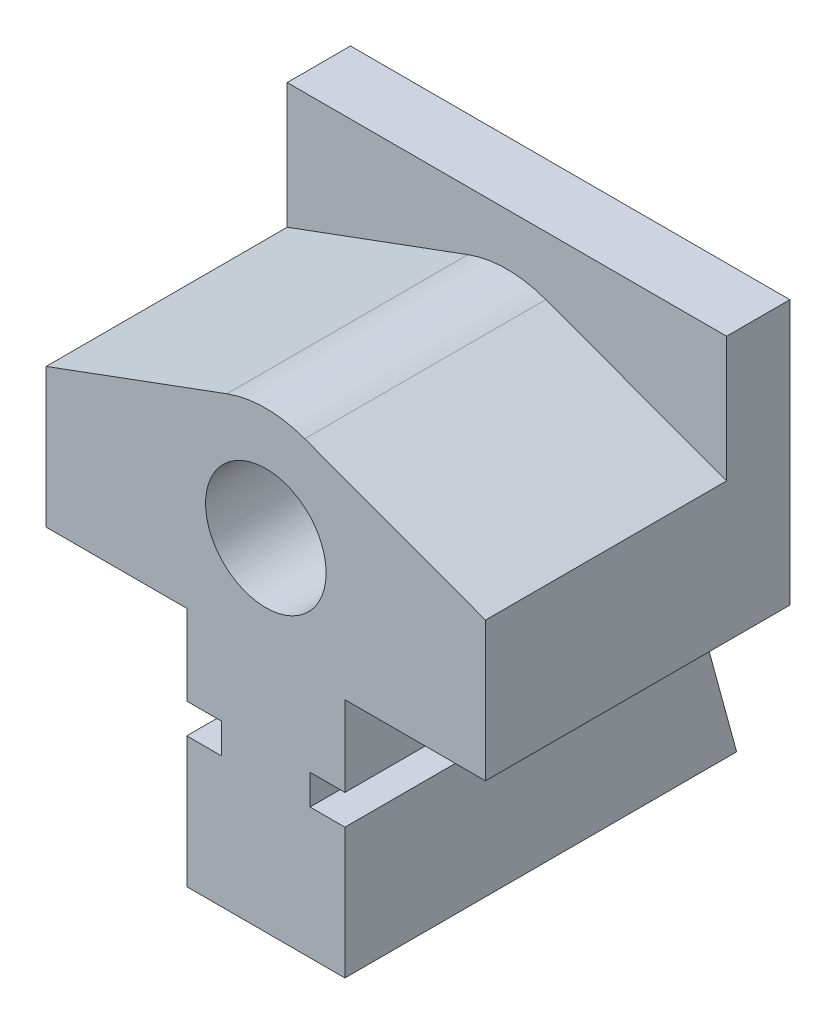
ISO-10303-21;
HEADER;
FILE_DESCRIPTION(('STEP AP214'),'2;1');
FILE_NAME('part.step','',(''),(''),'','','');
FILE_SCHEMA(('AUTOMOTIVE_DESIGN { 1 0 10303 214 1 1 1 1 }'));
ENDSEC;
DATA;
#1=APPLICATION_CONTEXT('core data for automotive mechanical design processes');
#2=APPLICATION_PROTOCOL_DEFINITION('international standard','automotive_design',2000,#1);
#3=PRODUCT_CONTEXT('',#1,'mechanical');
#4=PRODUCT('Part','Part','',(#3));
#5=PRODUCT_RELATED_PRODUCT_CATEGORY('part','',(#4));
#6=PRODUCT_DEFINITION_FORMATION('','',#4);
#7=PRODUCT_DEFINITION_CONTEXT('part definition',#1,'design');
#8=PRODUCT_DEFINITION('design','',#6,#7);
#9=PRODUCT_DEFINITION_SHAPE('','',#8);
#10=(LENGTH_UNIT() NAMED_UNIT(*) SI_UNIT(.MILLI.,.METRE.));
#11=(NAMED_UNIT(*) PLANE_ANGLE_UNIT() SI_UNIT($,.RADIAN.));
#12=(NAMED_UNIT(*) SI_UNIT($,.STERADIAN.) SOLID_ANGLE_UNIT());
#13=UNCERTAINTY_MEASURE_WITH_UNIT(LENGTH_MEASURE(1.E-05),#10,'distance_accuracy_value','');
#14=(GEOMETRIC_REPRESENTATION_CONTEXT(3) GLOBAL_UNCERTAINTY_ASSIGNED_CONTEXT((#13)) GLOBAL_UNIT_ASSIGNED_CONTEXT((#10,
#11,#12)) REPRESENTATION_CONTEXT('',''));
#15=CARTESIAN_POINT('',(0.,0.,0.));
#16=DIRECTION('',(0.,0.,1.));
#17=DIRECTION('',(1.,0.,0.));
#18=AXIS2_PLACEMENT_3D('',#15,#16,#17);
#19=CARTESIAN_POINT('',(-6.9882,20.6502,-38.1));
#20=DIRECTION('',(-1.,0.,0.));
#21=DIRECTION('',(0.,0.,1.));
#22=AXIS2_PLACEMENT_3D('',#19,#20,#21);
#23=PLANE('',#22);
#24=DIRECTION('',(0.,0.964763821237732,0.263117405792109));
#25=VECTOR('',#24,1.);
#26=CARTESIAN_POINT('',(-6.9882,25.2652823076923,-55.0219684615385));
#27=LINE('',#26,#25);
#28=CARTESIAN_POINT('',(-6.9882,20.6502,-56.2806272727273));
#29=VERTEX_POINT('',#28);
#30=CARTESIAN_POINT('',(-6.9882,25.4,-54.9852272727273));
#31=VERTEX_POINT('',#30);
#32=EDGE_CURVE('E470',#29,#31,#27,.T.);
#33=ORIENTED_EDGE('',*,*,#32,.F.);
#34=DIRECTION('',(0.,0.,1.));
#35=VECTOR('',#34,1.);
#36=CARTESIAN_POINT('',(-6.9882,20.6502,-38.1));
#37=LINE('',#36,#35);
#38=CARTESIAN_POINT('',(-6.9882,20.6502,-31.8067935663986));
#39=VERTEX_POINT('',#38);
#40=EDGE_CURVE('E390',#29,#39,#37,.T.);
#41=ORIENTED_EDGE('',*,*,#40,.T.);
#42=DIRECTION('',(0.,-1.,0.));
#43=VECTOR('',#42,1.);
#44=CARTESIAN_POINT('',(-6.9882,0.,-31.8067935663986));
#45=LINE('',#44,#43);
#46=CARTESIAN_POINT('',(-6.9882,25.4,-31.8067935663986));
#47=VERTEX_POINT('',#46);
#48=EDGE_CURVE('E329',#47,#39,#45,.T.);
#49=ORIENTED_EDGE('',*,*,#48,.F.);
#50=DIRECTION('',(0.,0.,1.));
#51=VECTOR('',#50,1.);
#52=CARTESIAN_POINT('',(-6.9882,25.4,-38.1));
#53=LINE('',#52,#51);
#54=EDGE_CURVE('E393',#31,#47,#53,.T.);
#55=ORIENTED_EDGE('',*,*,#54,.F.);
#56=EDGE_LOOP('',(#33,#41,#49,#55));
#57=FACE_BOUND('',#56,.T.);
#58=ADVANCED_FACE('F34',(#57),#23,.T.);
#59=CARTESIAN_POINT('',(6.9882,20.6502,-38.1));
#60=DIRECTION('',(1.,0.,0.));
#61=DIRECTION('',(0.,0.,-1.));
#62=AXIS2_PLACEMENT_3D('',#59,#60,#61);
#63=PLANE('',#62);
#64=DIRECTION('',(0.,-1.,0.));
#65=VECTOR('',#64,1.);
#66=CARTESIAN_POINT('',(6.9882,0.,-28.5182064336013));
#67=LINE('',#66,#65);
#68=CARTESIAN_POINT('',(6.9882,25.4,-28.5182064336013));
#69=VERTEX_POINT('',#68);
#70=CARTESIAN_POINT('',(6.9882,20.6502,-28.5182064336013));
#71=VERTEX_POINT('',#70);
#72=EDGE_CURVE('E348',#69,#71,#67,.T.);
#73=ORIENTED_EDGE('',*,*,#72,.F.);
#74=DIRECTION('',(0.,0.,1.));
#75=VECTOR('',#74,1.);
#76=CARTESIAN_POINT('',(6.9882,25.4,-38.1));
#77=LINE('',#76,#75);
#78=CARTESIAN_POINT('',(6.9882,25.4,0.));
#79=VERTEX_POINT('',#78);
#80=EDGE_CURVE('E378',#69,#79,#77,.T.);
#81=ORIENTED_EDGE('',*,*,#80,.T.);
#82=DIRECTION('',(0.,1.,0.));
#83=VECTOR('',#82,1.);
#84=CARTESIAN_POINT('',(6.9882,20.6502,0.));
#85=LINE('',#84,#83);
#86=CARTESIAN_POINT('',(6.9882,20.6502,0.));
#87=VERTEX_POINT('',#86);
#88=EDGE_CURVE('E447',#87,#79,#85,.T.);
#89=ORIENTED_EDGE('',*,*,#88,.F.);
#90=DIRECTION('',(0.,0.,1.));
#91=VECTOR('',#90,1.);
#92=CARTESIAN_POINT('',(6.9882,20.6502,-38.1));
#93=LINE('',#92,#91);
#94=EDGE_CURVE('E381',#71,#87,#93,.T.);
#95=ORIENTED_EDGE('',*,*,#94,.F.);
#96=EDGE_LOOP('',(#73,#81,#89,#95));
#97=FACE_BOUND('',#96,.T.);
#98=ADVANCED_FACE('F518',(#97),#63,.T.);
#99=CARTESIAN_POINT('',(12.5,38.1,-38.1));
#100=DIRECTION('',(0.,-1.,0.));
#101=DIRECTION('',(0.,0.,-1.));
#102=AXIS2_PLACEMENT_3D('',#99,#100,#101);
#103=PLANE('',#102);
#104=DIRECTION('',(0.,0.,1.));
#105=VECTOR('',#104,1.);
#106=CARTESIAN_POINT('',(12.5,38.1,-38.1));
#107=LINE('',#106,#105);
#108=CARTESIAN_POINT('',(12.5,38.1,-43.1));
#109=VERTEX_POINT('',#108);
#110=CARTESIAN_POINT('',(12.5,38.1,0.));
#111=VERTEX_POINT('',#110);
#112=EDGE_CURVE('E304',#109,#111,#107,.T.);
#113=ORIENTED_EDGE('',*,*,#112,.F.);
#114=DIRECTION('',(1.,0.,0.));
#115=VECTOR('',#114,1.);
#116=CARTESIAN_POINT('',(-34.72505,38.1,-43.1));
#117=LINE('',#116,#115);
#118=CARTESIAN_POINT('',(-12.5,38.1,-43.1));
#119=VERTEX_POINT('',#118);
#120=EDGE_CURVE('E350',#119,#109,#117,.T.);
#121=ORIENTED_EDGE('',*,*,#120,.F.);
#122=DIRECTION('',(0.,0.,1.));
#123=VECTOR('',#122,1.);
#124=CARTESIAN_POINT('',(-12.5,38.1,-38.1));
#125=LINE('',#124,#123);
#126=CARTESIAN_POINT('',(-12.5,38.1,0.));
#127=VERTEX_POINT('',#126);
#128=EDGE_CURVE('E301',#119,#127,#125,.T.);
#129=ORIENTED_EDGE('',*,*,#128,.T.);
#130=DIRECTION('',(1.,0.,0.));
#131=VECTOR('',#130,1.);
#132=CARTESIAN_POINT('',(-12.5,38.1,0.));
#133=LINE('',#132,#131);
#134=CARTESIAN_POINT('',(-34.725,38.1,0.));
#135=VERTEX_POINT('',#134);
#136=EDGE_CURVE('E421',#135,#127,#133,.T.);
#137=ORIENTED_EDGE('',*,*,#136,.F.);
#138=DIRECTION('',(0.,0.,1.));
#139=VECTOR('',#138,1.);
#140=CARTESIAN_POINT('',(-34.725,38.1,-38.1));
#141=LINE('',#140,#139);
#142=CARTESIAN_POINT('',(-34.725,38.1,-48.1));
#143=VERTEX_POINT('',#142);
#144=EDGE_CURVE('E366',#143,#135,#141,.T.);
#145=ORIENTED_EDGE('',*,*,#144,.F.);
#146=DIRECTION('',(-1.,0.,0.));
#147=VECTOR('',#146,1.);
#148=CARTESIAN_POINT('',(34.725,38.1,-48.1));
#149=LINE('',#148,#147);
#150=CARTESIAN_POINT('',(34.725,38.1,-48.1));
#151=VERTEX_POINT('',#150);
#152=EDGE_CURVE('E247',#151,#143,#149,.T.);
#153=ORIENTED_EDGE('',*,*,#152,.F.);
#154=DIRECTION('',(0.,0.,1.));
#155=VECTOR('',#154,1.);
#156=CARTESIAN_POINT('',(34.725,38.1,-38.1));
#157=LINE('',#156,#155);
#158=CARTESIAN_POINT('',(34.725,38.1,0.));
#159=VERTEX_POINT('',#158);
#160=EDGE_CURVE('E306',#151,#159,#157,.T.);
#161=ORIENTED_EDGE('',*,*,#160,.T.);
#162=DIRECTION('',(1.,0.,0.));
#163=VECTOR('',#162,1.);
#164=CARTESIAN_POINT('',(12.5,38.1,0.));
#165=LINE('',#164,#163);
#166=EDGE_CURVE('E362',#111,#159,#165,.T.);
#167=ORIENTED_EDGE('',*,*,#166,.F.);
#168=EDGE_LOOP('',(#113,#121,#129,#137,#145,#153,#161,#167));
#169=FACE_BOUND('',#168,.T.);
#170=ADVANCED_FACE('F360',(#169),#103,.T.);
#171=CARTESIAN_POINT('',(34.725,38.1,-38.1));
#172=DIRECTION('',(1.,0.,0.));
#173=DIRECTION('',(0.,0.,-1.));
#174=AXIS2_PLACEMENT_3D('',#171,#172,#173);
#175=PLANE('',#174);
#176=DIRECTION('',(0.,1.,0.));
#177=VECTOR('',#176,1.);
#178=CARTESIAN_POINT('',(34.725,38.1,0.));
#179=LINE('',#178,#177);
#180=CARTESIAN_POINT('',(34.725,60.1070633418544,0.));
#181=VERTEX_POINT('',#180);
#182=EDGE_CURVE('E416',#159,#181,#179,.T.);
#183=ORIENTED_EDGE('',*,*,#182,.F.);
#184=ORIENTED_EDGE('',*,*,#160,.F.);
#185=DIRECTION('',(0.,-1.,0.));
#186=VECTOR('',#185,1.);
#187=CARTESIAN_POINT('',(34.725,38.1,-48.1));
#188=LINE('',#187,#186);
#189=CARTESIAN_POINT('',(34.725,79.9140129649345,-48.1));
#190=VERTEX_POINT('',#189);
#191=EDGE_CURVE('E244',#190,#151,#188,.T.);
#192=ORIENTED_EDGE('',*,*,#191,.F.);
#193=DIRECTION('',(0.,0.,1.));
#194=VECTOR('',#193,1.);
#195=CARTESIAN_POINT('',(34.725,79.9140129649345,-48.1));
#196=LINE('',#195,#194);
#197=CARTESIAN_POINT('',(34.725,79.9140129649345,-38.1));
#198=VERTEX_POINT('',#197);
#199=EDGE_CURVE('E254',#190,#198,#196,.T.);
#200=ORIENTED_EDGE('',*,*,#199,.T.);
#201=DIRECTION('',(0.,-1.,0.));
#202=VECTOR('',#201,1.);
#203=CARTESIAN_POINT('',(34.725,38.1,-38.1));
#204=LINE('',#203,#202);
#205=CARTESIAN_POINT('',(34.725,60.1070633418544,-38.1));
#206=VERTEX_POINT('',#205);
#207=EDGE_CURVE('E243',#198,#206,#204,.T.);
#208=ORIENTED_EDGE('',*,*,#207,.T.);
#209=DIRECTION('',(0.,0.,1.));
#210=VECTOR('',#209,1.);
#211=CARTESIAN_POINT('',(34.725,60.1070633418544,-111.022498577848));
#212=LINE('',#211,#210);
#213=EDGE_CURVE('E292',#206,#181,#212,.T.);
#214=ORIENTED_EDGE('',*,*,#213,.T.);
#215=EDGE_LOOP('',(#183,#184,#192,#200,#208,#214));
#216=FACE_BOUND('',#215,.T.);
#217=ADVANCED_FACE('F36',(#216),#175,.T.);
#218=CARTESIAN_POINT('',(12.5,25.4,-38.1));
#219=DIRECTION('',(1.,0.,0.));
#220=DIRECTION('',(0.,0.,-1.));
#221=AXIS2_PLACEMENT_3D('',#218,#219,#220);
#222=PLANE('',#221);
#223=DIRECTION('',(0.,-0.964763821237732,-0.263117405792109));
#224=VECTOR('',#223,1.);
#225=CARTESIAN_POINT('',(12.5,29.68625,-53.81625));
#226=LINE('',#225,#224);
#227=CARTESIAN_POINT('',(12.5,34.925,-52.3875));
#228=VERTEX_POINT('',#227);
#229=CARTESIAN_POINT('',(12.5,25.4,-54.9852272727273));
#230=VERTEX_POINT('',#229);
#231=EDGE_CURVE('E212',#228,#230,#226,.T.);
#232=ORIENTED_EDGE('',*,*,#231,.F.);
#233=DIRECTION('',(0.,0.,-1.));
#234=VECTOR('',#233,1.);
#235=CARTESIAN_POINT('',(12.5,34.925,-38.1));
#236=LINE('',#235,#234);
#237=CARTESIAN_POINT('',(12.5,34.925,-46.275));
#238=VERTEX_POINT('',#237);
#239=EDGE_CURVE('E222',#238,#228,#236,.T.);
#240=ORIENTED_EDGE('',*,*,#239,.F.);
#241=CARTESIAN_POINT('',(12.5,38.1,-46.275));
#242=DIRECTION('',(1.,0.,0.));
#243=DIRECTION('',(0.,0.,-1.));
#244=AXIS2_PLACEMENT_3D('',#241,#242,#243);
#245=CIRCLE('',#244,3.17499999999999);
#246=EDGE_CURVE('E235',#109,#238,#245,.T.);
#247=ORIENTED_EDGE('',*,*,#246,.F.);
#248=ORIENTED_EDGE('',*,*,#112,.T.);
#249=DIRECTION('',(0.,1.,0.));
#250=VECTOR('',#249,1.);
#251=CARTESIAN_POINT('',(12.5,25.4,0.));
#252=LINE('',#251,#250);
#253=CARTESIAN_POINT('',(12.5,25.4,0.));
#254=VERTEX_POINT('',#253);
#255=EDGE_CURVE('E367',#254,#111,#252,.T.);
#256=ORIENTED_EDGE('',*,*,#255,.F.);
#257=DIRECTION('',(0.,0.,1.));
#258=VECTOR('',#257,1.);
#259=CARTESIAN_POINT('',(12.5,25.4,-38.1));
#260=LINE('',#259,#258);
#261=EDGE_CURVE('E224',#230,#254,#260,.T.);
#262=ORIENTED_EDGE('',*,*,#261,.F.);
#263=EDGE_LOOP('',(#232,#240,#247,#248,#256,#262));
#264=FACE_BOUND('',#263,.T.);
#265=ADVANCED_FACE('F220',(#264),#222,.T.);
#266=CARTESIAN_POINT('',(6.9882,25.4,-38.1));
#267=DIRECTION('',(0.,-1.,0.));
#268=DIRECTION('',(0.,0.,-1.));
#269=AXIS2_PLACEMENT_3D('',#266,#267,#268);
#270=PLANE('',#269);
#271=DIRECTION('',(-1.,0.,0.));
#272=VECTOR('',#271,1.);
#273=CARTESIAN_POINT('',(6.9882,25.4,-54.9852272727273));
#274=LINE('',#273,#272);
#275=CARTESIAN_POINT('',(6.9882,25.4,-54.9852272727273));
#276=VERTEX_POINT('',#275);
#277=EDGE_CURVE('E226',#230,#276,#274,.T.);
#278=ORIENTED_EDGE('',*,*,#277,.F.);
#279=ORIENTED_EDGE('',*,*,#261,.T.);
#280=DIRECTION('',(1.,0.,0.));
#281=VECTOR('',#280,1.);
#282=CARTESIAN_POINT('',(6.9882,25.4,0.));
#283=LINE('',#282,#281);
#284=EDGE_CURVE('E370',#79,#254,#283,.T.);
#285=ORIENTED_EDGE('',*,*,#284,.F.);
#286=ORIENTED_EDGE('',*,*,#80,.F.);
#287=CARTESIAN_POINT('',(7.9375,25.4,-30.1625));
#288=DIRECTION('',(0.,-1.,0.));
#289=DIRECTION('',(0.,0.,-1.));
#290=AXIS2_PLACEMENT_3D('',#287,#288,#289);
#291=CIRCLE('',#290,1.89865);
#292=CARTESIAN_POINT('',(6.9882,25.4,-31.8067935663986));
#293=VERTEX_POINT('',#292);
#294=EDGE_CURVE('E346',#293,#69,#291,.T.);
#295=ORIENTED_EDGE('',*,*,#294,.F.);
#296=EDGE_CURVE('E376',#276,#293,#77,.T.);
#297=ORIENTED_EDGE('',*,*,#296,.F.);
#298=EDGE_LOOP('',(#278,#279,#285,#286,#295,#297));
#299=FACE_BOUND('',#298,.T.);
#300=ADVANCED_FACE('F454',(#299),#270,.T.);
#301=DIRECTION('',(0.,-0.964763821237732,-0.263117405792109));
#302=VECTOR('',#301,1.);
#303=CARTESIAN_POINT('',(6.9882,25.2652823076923,-55.0219684615385));
#304=LINE('',#303,#302);
#305=CARTESIAN_POINT('',(6.9882,20.6502,-56.2806272727273));
#306=VERTEX_POINT('',#305);
#307=EDGE_CURVE('E458',#276,#306,#304,.T.);
#308=ORIENTED_EDGE('',*,*,#307,.F.);
#309=ORIENTED_EDGE('',*,*,#296,.T.);
#310=DIRECTION('',(0.,-1.,0.));
#311=VECTOR('',#310,1.);
#312=CARTESIAN_POINT('',(6.9882,0.,-31.8067935663986));
#313=LINE('',#312,#311);
#314=CARTESIAN_POINT('',(6.9882,20.6502,-31.8067935663986));
#315=VERTEX_POINT('',#314);
#316=EDGE_CURVE('E343',#315,#293,#313,.F.);
#317=ORIENTED_EDGE('',*,*,#316,.F.);
#318=EDGE_CURVE('E379',#306,#315,#93,.T.);
#319=ORIENTED_EDGE('',*,*,#318,.F.);
#320=EDGE_LOOP('',(#308,#309,#317,#319));
#321=FACE_BOUND('',#320,.T.);
#322=ADVANCED_FACE('F527',(#321),#63,.T.);
#323=CARTESIAN_POINT('',(12.5,20.6502,-38.1));
#324=DIRECTION('',(0.,1.,0.));
#325=DIRECTION('',(0.,0.,1.));
#326=AXIS2_PLACEMENT_3D('',#323,#324,#325);
#327=PLANE('',#326);
#328=DIRECTION('',(1.,0.,0.));
#329=VECTOR('',#328,1.);
#330=CARTESIAN_POINT('',(12.5,20.6502,-56.2806272727273));
#331=LINE('',#330,#329);
#332=CARTESIAN_POINT('',(12.5,20.6502,-56.2806272727273));
#333=VERTEX_POINT('',#332);
#334=EDGE_CURVE('E460',#306,#333,#331,.T.);
#335=ORIENTED_EDGE('',*,*,#334,.F.);
#336=ORIENTED_EDGE('',*,*,#318,.T.);
#337=CARTESIAN_POINT('',(7.9375,20.6502,-30.1625));
#338=DIRECTION('',(0.,1.,0.));
#339=DIRECTION('',(0.,0.,1.));
#340=AXIS2_PLACEMENT_3D('',#337,#338,#339);
#341=CIRCLE('',#340,1.89865);
#342=EDGE_CURVE('E340',#71,#315,#341,.T.);
#343=ORIENTED_EDGE('',*,*,#342,.F.);
#344=ORIENTED_EDGE('',*,*,#94,.T.);
#345=DIRECTION('',(-1.,0.,0.));
#346=VECTOR('',#345,1.);
#347=CARTESIAN_POINT('',(12.5,20.6502,0.));
#348=LINE('',#347,#346);
#349=CARTESIAN_POINT('',(12.5,20.6502,0.));
#350=VERTEX_POINT('',#349);
#351=EDGE_CURVE('E444',#350,#87,#348,.T.);
#352=ORIENTED_EDGE('',*,*,#351,.F.);
#353=DIRECTION('',(0.,0.,1.));
#354=VECTOR('',#353,1.);
#355=CARTESIAN_POINT('',(12.5,20.6502,-38.1));
#356=LINE('',#355,#354);
#357=EDGE_CURVE('E382',#333,#350,#356,.T.);
#358=ORIENTED_EDGE('',*,*,#357,.F.);
#359=EDGE_LOOP('',(#335,#336,#343,#344,#352,#358));
#360=FACE_BOUND('',#359,.T.);
#361=ADVANCED_FACE('F562',(#360),#327,.T.);
#362=CARTESIAN_POINT('',(12.5,0.,-38.1));
#363=DIRECTION('',(1.,0.,0.));
#364=DIRECTION('',(0.,0.,-1.));
#365=AXIS2_PLACEMENT_3D('',#362,#363,#364);
#366=PLANE('',#365);
#367=DIRECTION('',(0.,-0.964763821237732,-0.263117405792109));
#368=VECTOR('',#367,1.);
#369=CARTESIAN_POINT('',(12.5,6.04471153846153,-60.2639423076923));
#370=LINE('',#369,#368);
#371=CARTESIAN_POINT('',(12.5,0.,-61.9125));
#372=VERTEX_POINT('',#371);
#373=EDGE_CURVE('E464',#333,#372,#370,.T.);
#374=ORIENTED_EDGE('',*,*,#373,.F.);
#375=ORIENTED_EDGE('',*,*,#357,.T.);
#376=DIRECTION('',(0.,1.,0.));
#377=VECTOR('',#376,1.);
#378=CARTESIAN_POINT('',(12.5,0.,0.));
#379=LINE('',#378,#377);
#380=CARTESIAN_POINT('',(12.5,0.,0.));
#381=VERTEX_POINT('',#380);
#382=EDGE_CURVE('E441',#381,#350,#379,.T.);
#383=ORIENTED_EDGE('',*,*,#382,.F.);
#384=DIRECTION('',(0.,0.,1.));
#385=VECTOR('',#384,1.);
#386=CARTESIAN_POINT('',(12.5,0.,-38.1));
#387=LINE('',#386,#385);
#388=EDGE_CURVE('E384',#372,#381,#387,.T.);
#389=ORIENTED_EDGE('',*,*,#388,.F.);
#390=EDGE_LOOP('',(#374,#375,#383,#389));
#391=FACE_BOUND('',#390,.T.);
#392=ADVANCED_FACE('F557',(#391),#366,.T.);
#393=CARTESIAN_POINT('',(12.5,0.,-38.1));
#394=DIRECTION('',(0.,-1.,0.));
#395=DIRECTION('',(0.,0.,-1.));
#396=AXIS2_PLACEMENT_3D('',#393,#394,#395);
#397=PLANE('',#396);
#398=CARTESIAN_POINT('',(-7.9375,0.,-30.1625));
#399=DIRECTION('',(0.,-1.,0.));
#400=DIRECTION('',(0.,0.,-1.));
#401=AXIS2_PLACEMENT_3D('',#398,#399,#400);
#402=CIRCLE('',#401,1.89865);
#403=CARTESIAN_POINT('',(-7.9375,0.,-32.06115));
#404=VERTEX_POINT('',#403);
#405=EDGE_CURVE('E325',#404,#404,#402,.T.);
#406=ORIENTED_EDGE('',*,*,#405,.F.);
#407=EDGE_LOOP('',(#406));
#408=FACE_BOUND('',#407,.T.);
#409=CARTESIAN_POINT('',(7.9375,0.,-30.1625));
#410=DIRECTION('',(0.,-1.,0.));
#411=DIRECTION('',(0.,0.,-1.));
#412=AXIS2_PLACEMENT_3D('',#409,#410,#411);
#413=CIRCLE('',#412,1.89865);
#414=CARTESIAN_POINT('',(7.9375,0.,-32.06115));
#415=VERTEX_POINT('',#414);
#416=EDGE_CURVE('E337',#415,#415,#413,.T.);
#417=ORIENTED_EDGE('',*,*,#416,.F.);
#418=EDGE_LOOP('',(#417));
#419=FACE_BOUND('',#418,.T.);
#420=DIRECTION('',(1.,0.,0.));
#421=VECTOR('',#420,1.);
#422=CARTESIAN_POINT('',(12.5,0.,0.));
#423=LINE('',#422,#421);
#424=CARTESIAN_POINT('',(-12.5,0.,0.));
#425=VERTEX_POINT('',#424);
#426=EDGE_CURVE('E438',#425,#381,#423,.T.);
#427=ORIENTED_EDGE('',*,*,#426,.F.);
#428=DIRECTION('',(0.,0.,1.));
#429=VECTOR('',#428,1.);
#430=CARTESIAN_POINT('',(-12.5,0.,-38.1));
#431=LINE('',#430,#429);
#432=CARTESIAN_POINT('',(-12.5,0.,-61.9125));
#433=VERTEX_POINT('',#432);
#434=EDGE_CURVE('E386',#433,#425,#431,.T.);
#435=ORIENTED_EDGE('',*,*,#434,.F.);
#436=DIRECTION('',(-1.,0.,0.));
#437=VECTOR('',#436,1.);
#438=CARTESIAN_POINT('',(12.5,0.,-61.9125));
#439=LINE('',#438,#437);
#440=EDGE_CURVE('E241',#372,#433,#439,.T.);
#441=ORIENTED_EDGE('',*,*,#440,.F.);
#442=ORIENTED_EDGE('',*,*,#388,.T.);
#443=EDGE_LOOP('',(#427,#435,#441,#442));
#444=FACE_BOUND('',#443,.T.);
#445=ADVANCED_FACE('F552',(#408,#419,#444),#397,.T.);
#446=CARTESIAN_POINT('',(-12.5,0.,-38.1));
#447=DIRECTION('',(-1.,0.,0.));
#448=DIRECTION('',(0.,0.,1.));
#449=AXIS2_PLACEMENT_3D('',#446,#447,#448);
#450=PLANE('',#449);
#451=DIRECTION('',(0.,0.964763821237732,0.263117405792109));
#452=VECTOR('',#451,1.);
#453=CARTESIAN_POINT('',(-12.5,6.04471153846153,-60.2639423076923));
#454=LINE('',#453,#452);
#455=CARTESIAN_POINT('',(-12.5,20.6502,-56.2806272727273));
#456=VERTEX_POINT('',#455);
#457=EDGE_CURVE('E466',#433,#456,#454,.T.);
#458=ORIENTED_EDGE('',*,*,#457,.F.);
#459=ORIENTED_EDGE('',*,*,#434,.T.);
#460=DIRECTION('',(0.,-1.,0.));
#461=VECTOR('',#460,1.);
#462=CARTESIAN_POINT('',(-12.5,0.,0.));
#463=LINE('',#462,#461);
#464=CARTESIAN_POINT('',(-12.5,20.6502,0.));
#465=VERTEX_POINT('',#464);
#466=EDGE_CURVE('E435',#465,#425,#463,.T.);
#467=ORIENTED_EDGE('',*,*,#466,.F.);
#468=DIRECTION('',(0.,0.,1.));
#469=VECTOR('',#468,1.);
#470=CARTESIAN_POINT('',(-12.5,20.6502,-38.1));
#471=LINE('',#470,#469);
#472=EDGE_CURVE('E388',#456,#465,#471,.T.);
#473=ORIENTED_EDGE('',*,*,#472,.F.);
#474=EDGE_LOOP('',(#458,#459,#467,#473));
#475=FACE_BOUND('',#474,.T.);
#476=ADVANCED_FACE('F537',(#475),#450,.T.);
#477=CARTESIAN_POINT('',(-12.5,20.6502,-38.1));
#478=DIRECTION('',(0.,1.,0.));
#479=DIRECTION('',(0.,0.,1.));
#480=AXIS2_PLACEMENT_3D('',#477,#478,#479);
#481=PLANE('',#480);
#482=DIRECTION('',(1.,0.,0.));
#483=VECTOR('',#482,1.);
#484=CARTESIAN_POINT('',(-12.5,20.6502,-56.2806272727273));
#485=LINE('',#484,#483);
#486=EDGE_CURVE('E468',#456,#29,#485,.T.);
#487=ORIENTED_EDGE('',*,*,#486,.F.);
#488=ORIENTED_EDGE('',*,*,#472,.T.);
#489=DIRECTION('',(-1.,0.,0.));
#490=VECTOR('',#489,1.);
#491=CARTESIAN_POINT('',(-12.5,20.6502,0.));
#492=LINE('',#491,#490);
#493=CARTESIAN_POINT('',(-6.9882,20.6502,0.));
#494=VERTEX_POINT('',#493);
#495=EDGE_CURVE('E432',#494,#465,#492,.T.);
#496=ORIENTED_EDGE('',*,*,#495,.F.);
#497=CARTESIAN_POINT('',(-6.9882,20.6502,-28.5182064336013));
#498=VERTEX_POINT('',#497);
#499=EDGE_CURVE('E392',#498,#494,#37,.T.);
#500=ORIENTED_EDGE('',*,*,#499,.F.);
#501=CARTESIAN_POINT('',(-7.9375,20.6502,-30.1625));
#502=DIRECTION('',(0.,1.,0.));
#503=DIRECTION('',(0.,0.,1.));
#504=AXIS2_PLACEMENT_3D('',#501,#502,#503);
#505=CIRCLE('',#504,1.89865);
#506=EDGE_CURVE('E332',#39,#498,#505,.T.);
#507=ORIENTED_EDGE('',*,*,#506,.F.);
#508=ORIENTED_EDGE('',*,*,#40,.F.);
#509=EDGE_LOOP('',(#487,#488,#496,#500,#507,#508));
#510=FACE_BOUND('',#509,.T.);
#511=ADVANCED_FACE('F531',(#510),#481,.T.);
#512=DIRECTION('',(0.,-1.,0.));
#513=VECTOR('',#512,1.);
#514=CARTESIAN_POINT('',(-6.9882,0.,-28.5182064336013));
#515=LINE('',#514,#513);
#516=CARTESIAN_POINT('',(-6.9882,25.4,-28.5182064336013));
#517=VERTEX_POINT('',#516);
#518=EDGE_CURVE('E56',#498,#517,#515,.F.);
#519=ORIENTED_EDGE('',*,*,#518,.F.);
#520=ORIENTED_EDGE('',*,*,#499,.T.);
#521=DIRECTION('',(0.,-1.,0.));
#522=VECTOR('',#521,1.);
#523=CARTESIAN_POINT('',(-6.9882,20.6502,0.));
#524=LINE('',#523,#522);
#525=CARTESIAN_POINT('',(-6.9882,25.4,0.));
#526=VERTEX_POINT('',#525);
#527=EDGE_CURVE('E429',#526,#494,#524,.T.);
#528=ORIENTED_EDGE('',*,*,#527,.F.);
#529=EDGE_CURVE('E395',#517,#526,#53,.T.);
#530=ORIENTED_EDGE('',*,*,#529,.F.);
#531=EDGE_LOOP('',(#519,#520,#528,#530));
#532=FACE_BOUND('',#531,.T.);
#533=ADVANCED_FACE('F521',(#532),#23,.T.);
#534=CARTESIAN_POINT('',(-6.9882,25.4,-38.1));
#535=DIRECTION('',(0.,-1.,0.));
#536=DIRECTION('',(0.,0.,-1.));
#537=AXIS2_PLACEMENT_3D('',#534,#535,#536);
#538=PLANE('',#537);
#539=DIRECTION('',(-1.,0.,0.));
#540=VECTOR('',#539,1.);
#541=CARTESIAN_POINT('',(-6.9882,25.4,-54.9852272727273));
#542=LINE('',#541,#540);
#543=CARTESIAN_POINT('',(-12.5,25.4,-54.9852272727273));
#544=VERTEX_POINT('',#543);
#545=EDGE_CURVE('E472',#31,#544,#542,.T.);
#546=ORIENTED_EDGE('',*,*,#545,.F.);
#547=ORIENTED_EDGE('',*,*,#54,.T.);
#548=CARTESIAN_POINT('',(-7.9375,25.4,-30.1625));
#549=DIRECTION('',(0.,-1.,0.));
#550=DIRECTION('',(0.,0.,-1.));
#551=AXIS2_PLACEMENT_3D('',#548,#549,#550);
#552=CIRCLE('',#551,1.89865);
#553=EDGE_CURVE('E42',#517,#47,#552,.T.);
#554=ORIENTED_EDGE('',*,*,#553,.F.);
#555=ORIENTED_EDGE('',*,*,#529,.T.);
#556=DIRECTION('',(1.,0.,0.));
#557=VECTOR('',#556,1.);
#558=CARTESIAN_POINT('',(-6.9882,25.4,0.));
#559=LINE('',#558,#557);
#560=CARTESIAN_POINT('',(-12.5,25.4,0.));
#561=VERTEX_POINT('',#560);
#562=EDGE_CURVE('E426',#561,#526,#559,.T.);
#563=ORIENTED_EDGE('',*,*,#562,.F.);
#564=DIRECTION('',(0.,0.,1.));
#565=VECTOR('',#564,1.);
#566=CARTESIAN_POINT('',(-12.5,25.4,-38.1));
#567=LINE('',#566,#565);
#568=EDGE_CURVE('E396',#544,#561,#567,.T.);
#569=ORIENTED_EDGE('',*,*,#568,.F.);
#570=EDGE_LOOP('',(#546,#547,#554,#555,#563,#569));
#571=FACE_BOUND('',#570,.T.);
#572=ADVANCED_FACE('F483',(#571),#538,.T.);
#573=CARTESIAN_POINT('',(-12.5,25.4,-38.1));
#574=DIRECTION('',(-1.,0.,0.));
#575=DIRECTION('',(0.,0.,1.));
#576=AXIS2_PLACEMENT_3D('',#573,#574,#575);
#577=PLANE('',#576);
#578=DIRECTION('',(0.,0.964763821237732,0.263117405792109));
#579=VECTOR('',#578,1.);
#580=CARTESIAN_POINT('',(-12.5,29.68625,-53.81625));
#581=LINE('',#580,#579);
#582=CARTESIAN_POINT('',(-12.5,34.925,-52.3875));
#583=VERTEX_POINT('',#582);
#584=EDGE_CURVE('E49',#544,#583,#581,.T.);
#585=ORIENTED_EDGE('',*,*,#584,.F.);
#586=ORIENTED_EDGE('',*,*,#568,.T.);
#587=DIRECTION('',(0.,-1.,0.));
#588=VECTOR('',#587,1.);
#589=CARTESIAN_POINT('',(-12.5,25.4,0.));
#590=LINE('',#589,#588);
#591=EDGE_CURVE('E423',#127,#561,#590,.T.);
#592=ORIENTED_EDGE('',*,*,#591,.F.);
#593=ORIENTED_EDGE('',*,*,#128,.F.);
#594=CARTESIAN_POINT('',(-12.5,38.1,-46.275));
#595=DIRECTION('',(-1.,0.,0.));
#596=DIRECTION('',(0.,0.,1.));
#597=AXIS2_PLACEMENT_3D('',#594,#595,#596);
#598=CIRCLE('',#597,3.17499999999999);
#599=CARTESIAN_POINT('',(-12.5,34.925,-46.275));
#600=VERTEX_POINT('',#599);
#601=EDGE_CURVE('E232',#600,#119,#598,.T.);
#602=ORIENTED_EDGE('',*,*,#601,.F.);
#603=DIRECTION('',(0.,0.,1.));
#604=VECTOR('',#603,1.);
#605=CARTESIAN_POINT('',(-12.5,34.925,-38.1));
#606=LINE('',#605,#604);
#607=EDGE_CURVE('E233',#583,#600,#606,.T.);
#608=ORIENTED_EDGE('',*,*,#607,.F.);
#609=EDGE_LOOP('',(#585,#586,#592,#593,#602,#608));
#610=FACE_BOUND('',#609,.T.);
#611=ADVANCED_FACE('F480',(#610),#577,.T.);
#612=CARTESIAN_POINT('',(-34.725,38.1,-38.1));
#613=DIRECTION('',(-1.,0.,0.));
#614=DIRECTION('',(0.,0.,1.));
#615=AXIS2_PLACEMENT_3D('',#612,#613,#614);
#616=PLANE('',#615);
#617=DIRECTION('',(0.,-1.,0.));
#618=VECTOR('',#617,1.);
#619=CARTESIAN_POINT('',(-34.725,38.1,0.));
#620=LINE('',#619,#618);
#621=CARTESIAN_POINT('',(-34.725,60.1070633418544,0.));
#622=VERTEX_POINT('',#621);
#623=EDGE_CURVE('E408',#622,#135,#620,.T.);
#624=ORIENTED_EDGE('',*,*,#623,.F.);
#625=DIRECTION('',(0.,0.,1.));
#626=VECTOR('',#625,1.);
#627=CARTESIAN_POINT('',(-34.725,60.1070633418544,-111.022498577848));
#628=LINE('',#627,#626);
#629=CARTESIAN_POINT('',(-34.725,60.1070633418544,-38.1));
#630=VERTEX_POINT('',#629);
#631=EDGE_CURVE('E285',#630,#622,#628,.T.);
#632=ORIENTED_EDGE('',*,*,#631,.F.);
#633=DIRECTION('',(0.,1.,0.));
#634=VECTOR('',#633,1.);
#635=CARTESIAN_POINT('',(-34.725,38.1,-38.1));
#636=LINE('',#635,#634);
#637=CARTESIAN_POINT('',(-34.725,79.9140129649345,-38.1));
#638=VERTEX_POINT('',#637);
#639=EDGE_CURVE('E263',#630,#638,#636,.T.);
#640=ORIENTED_EDGE('',*,*,#639,.T.);
#641=DIRECTION('',(0.,0.,1.));
#642=VECTOR('',#641,1.);
#643=CARTESIAN_POINT('',(-34.725,79.9140129649345,-48.1));
#644=LINE('',#643,#642);
#645=CARTESIAN_POINT('',(-34.725,79.9140129649345,-48.1));
#646=VERTEX_POINT('',#645);
#647=EDGE_CURVE('E264',#646,#638,#644,.T.);
#648=ORIENTED_EDGE('',*,*,#647,.F.);
#649=DIRECTION('',(0.,1.,0.));
#650=VECTOR('',#649,1.);
#651=CARTESIAN_POINT('',(-34.725,38.1,-48.1));
#652=LINE('',#651,#650);
#653=EDGE_CURVE('E250',#143,#646,#652,.T.);
#654=ORIENTED_EDGE('',*,*,#653,.F.);
#655=ORIENTED_EDGE('',*,*,#144,.T.);
#656=EDGE_LOOP('',(#624,#632,#640,#648,#654,#655));
#657=FACE_BOUND('',#656,.T.);
#658=ADVANCED_FACE('F490',(#657),#616,.T.);
#659=CARTESIAN_POINT('',(34.725,49.5065900383141,0.));
#660=DIRECTION('',(0.,0.,-1.));
#661=DIRECTION('',(-1.,0.,0.));
#662=AXIS2_PLACEMENT_3D('',#659,#660,#661);
#663=PLANE('',#662);
#664=CARTESIAN_POINT('',(0.,53.9614342886389,0.));
#665=DIRECTION('',(0.,0.,1.));
#666=DIRECTION('',(1.,0.,0.));
#667=AXIS2_PLACEMENT_3D('',#664,#665,#666);
#668=CIRCLE('',#667,9.525);
#669=CARTESIAN_POINT('',(9.525,53.9614342886389,0.));
#670=VERTEX_POINT('',#669);
#671=EDGE_CURVE('E309',#670,#670,#668,.T.);
#672=ORIENTED_EDGE('',*,*,#671,.F.);
#673=EDGE_LOOP('',(#672));
#674=FACE_BOUND('',#673,.T.);
#675=ORIENTED_EDGE('',*,*,#182,.T.);
#676=DIRECTION('',(-0.938244637994089,0.345972541215833,0.));
#677=VECTOR('',#676,1.);
#678=CARTESIAN_POINT('',(6.15139178281752,70.6434239521738,0.));
#679=LINE('',#678,#677);
#680=CARTESIAN_POINT('',(6.15139178281752,70.6434239521738,0.));
#681=VERTEX_POINT('',#680);
#682=EDGE_CURVE('E267',#181,#681,#679,.T.);
#683=ORIENTED_EDGE('',*,*,#682,.T.);
#684=CARTESIAN_POINT('',(0.,53.9614342886389,0.));
#685=DIRECTION('',(0.,0.,1.));
#686=DIRECTION('',(1.,0.,0.));
#687=AXIS2_PLACEMENT_3D('',#684,#685,#686);
#688=CIRCLE('',#687,17.78);
#689=CARTESIAN_POINT('',(-6.15139178281752,70.6434239521738,0.));
#690=VERTEX_POINT('',#689);
#691=EDGE_CURVE('E274',#681,#690,#688,.T.);
#692=ORIENTED_EDGE('',*,*,#691,.T.);
#693=DIRECTION('',(-0.938244637994089,-0.345972541215833,0.));
#694=VECTOR('',#693,1.);
#695=CARTESIAN_POINT('',(-6.15139178281752,70.6434239521738,0.));
#696=LINE('',#695,#694);
#697=EDGE_CURVE('E271',#690,#622,#696,.T.);
#698=ORIENTED_EDGE('',*,*,#697,.T.);
#699=ORIENTED_EDGE('',*,*,#623,.T.);
#700=ORIENTED_EDGE('',*,*,#136,.T.);
#701=ORIENTED_EDGE('',*,*,#591,.T.);
#702=ORIENTED_EDGE('',*,*,#562,.T.);
#703=ORIENTED_EDGE('',*,*,#527,.T.);
#704=ORIENTED_EDGE('',*,*,#495,.T.);
#705=ORIENTED_EDGE('',*,*,#466,.T.);
#706=ORIENTED_EDGE('',*,*,#426,.T.);
#707=ORIENTED_EDGE('',*,*,#382,.T.);
#708=ORIENTED_EDGE('',*,*,#351,.T.);
#709=ORIENTED_EDGE('',*,*,#88,.T.);
#710=ORIENTED_EDGE('',*,*,#284,.T.);
#711=ORIENTED_EDGE('',*,*,#255,.T.);
#712=ORIENTED_EDGE('',*,*,#166,.T.);
#713=EDGE_LOOP('',(#675,#683,#692,#698,#699,#700,#701,#702,#703,#704,#705,#706,#707,#708,#709,
#710,#711,#712));
#714=FACE_BOUND('',#713,.T.);
#715=ADVANCED_FACE('F406',(#674,#714),#663,.F.);
#716=CARTESIAN_POINT('',(-6.15139178281752,70.6434239521738,-111.022498577848));
#717=DIRECTION('',(-0.345972541215833,0.938244637994089,0.));
#718=DIRECTION('',(-0.938244637994089,-0.345972541215833,0.));
#719=AXIS2_PLACEMENT_3D('',#716,#717,#718);
#720=PLANE('',#719);
#721=DIRECTION('',(0.,0.,1.));
#722=VECTOR('',#721,1.);
#723=CARTESIAN_POINT('',(-6.15139178281752,70.6434239521738,-111.022498577848));
#724=LINE('',#723,#722);
#725=CARTESIAN_POINT('',(-6.15139178281752,70.6434239521738,-38.1));
#726=VERTEX_POINT('',#725);
#727=EDGE_CURVE('E415',#726,#690,#724,.T.);
#728=ORIENTED_EDGE('',*,*,#727,.F.);
#729=DIRECTION('',(-0.938244637994089,-0.345972541215833,0.));
#730=VECTOR('',#729,1.);
#731=CARTESIAN_POINT('',(-6.15139178281752,70.6434239521738,-38.1));
#732=LINE('',#731,#730);
#733=EDGE_CURVE('E270',#726,#630,#732,.T.);
#734=ORIENTED_EDGE('',*,*,#733,.T.);
#735=ORIENTED_EDGE('',*,*,#631,.T.);
#736=ORIENTED_EDGE('',*,*,#697,.F.);
#737=EDGE_LOOP('',(#728,#734,#735,#736));
#738=FACE_BOUND('',#737,.T.);
#739=ADVANCED_FACE('F403',(#738),#720,.T.);
#740=CARTESIAN_POINT('',(6.15139178281752,70.6434239521738,-111.022498577848));
#741=DIRECTION('',(0.345972541215833,0.938244637994089,0.));
#742=DIRECTION('',(-0.938244637994089,0.345972541215833,0.));
#743=AXIS2_PLACEMENT_3D('',#740,#741,#742);
#744=PLANE('',#743);
#745=ORIENTED_EDGE('',*,*,#213,.F.);
#746=DIRECTION('',(-0.938244637994089,0.345972541215833,0.));
#747=VECTOR('',#746,1.);
#748=CARTESIAN_POINT('',(6.15139178281752,70.6434239521738,-38.1));
#749=LINE('',#748,#747);
#750=CARTESIAN_POINT('',(6.15139178281752,70.6434239521738,-38.1));
#751=VERTEX_POINT('',#750);
#752=EDGE_CURVE('E288',#206,#751,#749,.T.);
#753=ORIENTED_EDGE('',*,*,#752,.T.);
#754=DIRECTION('',(0.,0.,1.));
#755=VECTOR('',#754,1.);
#756=CARTESIAN_POINT('',(6.15139178281752,70.6434239521738,-111.022498577848));
#757=LINE('',#756,#755);
#758=EDGE_CURVE('E291',#751,#681,#757,.T.);
#759=ORIENTED_EDGE('',*,*,#758,.T.);
#760=ORIENTED_EDGE('',*,*,#682,.F.);
#761=EDGE_LOOP('',(#745,#753,#759,#760));
#762=FACE_BOUND('',#761,.T.);
#763=ADVANCED_FACE('F502',(#762),#744,.T.);
#764=CARTESIAN_POINT('',(0.,53.9614342886389,-111.022498577848));
#765=DIRECTION('',(0.,0.,1.));
#766=DIRECTION('',(1.,0.,0.));
#767=AXIS2_PLACEMENT_3D('',#764,#765,#766);
#768=CYLINDRICAL_SURFACE('',#767,17.78);
#769=ORIENTED_EDGE('',*,*,#758,.F.);
#770=CARTESIAN_POINT('',(0.,53.9614342886389,-38.1));
#771=DIRECTION('',(0.,0.,-1.));
#772=DIRECTION('',(-1.,0.,0.));
#773=AXIS2_PLACEMENT_3D('',#770,#771,#772);
#774=CIRCLE('',#773,17.78);
#775=EDGE_CURVE('E279',#751,#726,#774,.F.);
#776=ORIENTED_EDGE('',*,*,#775,.T.);
#777=ORIENTED_EDGE('',*,*,#727,.T.);
#778=ORIENTED_EDGE('',*,*,#691,.F.);
#779=EDGE_LOOP('',(#769,#776,#777,#778));
#780=FACE_BOUND('',#779,.T.);
#781=ADVANCED_FACE('F413',(#780),#768,.T.);
#782=CARTESIAN_POINT('',(34.725,79.9140129649345,-38.1));
#783=DIRECTION('',(0.,0.,1.));
#784=DIRECTION('',(1.,0.,0.));
#785=AXIS2_PLACEMENT_3D('',#782,#783,#784);
#786=PLANE('',#785);
#787=ORIENTED_EDGE('',*,*,#733,.F.);
#788=ORIENTED_EDGE('',*,*,#775,.F.);
#789=ORIENTED_EDGE('',*,*,#752,.F.);
#790=ORIENTED_EDGE('',*,*,#207,.F.);
#791=DIRECTION('',(1.,0.,0.));
#792=VECTOR('',#791,1.);
#793=CARTESIAN_POINT('',(34.725,79.9140129649345,-38.1));
#794=LINE('',#793,#792);
#795=EDGE_CURVE('E248',#638,#198,#794,.T.);
#796=ORIENTED_EDGE('',*,*,#795,.F.);
#797=ORIENTED_EDGE('',*,*,#639,.F.);
#798=EDGE_LOOP('',(#787,#788,#789,#790,#796,#797));
#799=FACE_BOUND('',#798,.T.);
#800=ADVANCED_FACE('F504',(#799),#786,.T.);
#801=CARTESIAN_POINT('',(34.725,79.9140129649345,-48.1));
#802=DIRECTION('',(0.,-1.,0.));
#803=DIRECTION('',(0.,0.,-1.));
#804=AXIS2_PLACEMENT_3D('',#801,#802,#803);
#805=PLANE('',#804);
#806=ORIENTED_EDGE('',*,*,#795,.T.);
#807=ORIENTED_EDGE('',*,*,#199,.F.);
#808=DIRECTION('',(1.,0.,0.));
#809=VECTOR('',#808,1.);
#810=CARTESIAN_POINT('',(34.725,79.9140129649345,-48.1));
#811=LINE('',#810,#809);
#812=EDGE_CURVE('E252',#646,#190,#811,.T.);
#813=ORIENTED_EDGE('',*,*,#812,.F.);
#814=ORIENTED_EDGE('',*,*,#647,.T.);
#815=EDGE_LOOP('',(#806,#807,#813,#814));
#816=FACE_BOUND('',#815,.T.);
#817=ADVANCED_FACE('F507',(#816),#805,.F.);
#818=CARTESIAN_POINT('',(34.725,79.9140129649345,-48.1));
#819=DIRECTION('',(0.,0.,1.));
#820=DIRECTION('',(1.,0.,0.));
#821=AXIS2_PLACEMENT_3D('',#818,#819,#820);
#822=PLANE('',#821);
#823=CARTESIAN_POINT('',(0.,53.9614342886389,-48.1));
#824=DIRECTION('',(0.,0.,1.));
#825=DIRECTION('',(1.,0.,0.));
#826=AXIS2_PLACEMENT_3D('',#823,#824,#825);
#827=CIRCLE('',#826,10.31875);
#828=CARTESIAN_POINT('',(10.31875,53.9614342886389,-48.1));
#829=VERTEX_POINT('',#828);
#830=EDGE_CURVE('E307',#829,#829,#827,.T.);
#831=ORIENTED_EDGE('',*,*,#830,.T.);
#832=EDGE_LOOP('',(#831));
#833=FACE_BOUND('',#832,.T.);
#834=ORIENTED_EDGE('',*,*,#191,.T.);
#835=ORIENTED_EDGE('',*,*,#152,.T.);
#836=ORIENTED_EDGE('',*,*,#653,.T.);
#837=ORIENTED_EDGE('',*,*,#812,.T.);
#838=EDGE_LOOP('',(#834,#835,#836,#837));
#839=FACE_BOUND('',#838,.T.);
#840=ADVANCED_FACE('F494',(#833,#839),#822,.F.);
#841=CARTESIAN_POINT('',(-34.72505,34.925,-61.9125));
#842=DIRECTION('',(0.,-1.,0.));
#843=DIRECTION('',(0.,0.,-1.));
#844=AXIS2_PLACEMENT_3D('',#841,#842,#843);
#845=PLANE('',#844);
#846=ORIENTED_EDGE('',*,*,#239,.T.);
#847=DIRECTION('',(-1.,0.,0.));
#848=VECTOR('',#847,1.);
#849=CARTESIAN_POINT('',(-34.72505,34.925,-52.3875));
#850=LINE('',#849,#848);
#851=EDGE_CURVE('E12',#228,#583,#850,.T.);
#852=ORIENTED_EDGE('',*,*,#851,.T.);
#853=ORIENTED_EDGE('',*,*,#607,.T.);
#854=DIRECTION('',(1.,0.,0.));
#855=VECTOR('',#854,1.);
#856=CARTESIAN_POINT('',(-34.72505,34.925,-46.275));
#857=LINE('',#856,#855);
#858=EDGE_CURVE('E231',#600,#238,#857,.T.);
#859=ORIENTED_EDGE('',*,*,#858,.T.);
#860=EDGE_LOOP('',(#846,#852,#853,#859));
#861=FACE_BOUND('',#860,.T.);
#862=ADVANCED_FACE('F229',(#861),#845,.F.);
#863=CARTESIAN_POINT('',(-34.72505,38.1,-46.275));
#864=DIRECTION('',(1.,0.,0.));
#865=DIRECTION('',(0.,0.,-1.));
#866=AXIS2_PLACEMENT_3D('',#863,#864,#865);
#867=CYLINDRICAL_SURFACE('',#866,3.17499999999999);
#868=ORIENTED_EDGE('',*,*,#246,.T.);
#869=ORIENTED_EDGE('',*,*,#858,.F.);
#870=ORIENTED_EDGE('',*,*,#601,.T.);
#871=ORIENTED_EDGE('',*,*,#120,.T.);
#872=EDGE_LOOP('',(#868,#869,#870,#871));
#873=FACE_BOUND('',#872,.T.);
#874=ADVANCED_FACE('F353',(#873),#867,.F.);
#875=CARTESIAN_POINT('',(7.9375,0.,-30.1625));
#876=DIRECTION('',(0.,-1.,0.));
#877=DIRECTION('',(0.,0.,-1.));
#878=AXIS2_PLACEMENT_3D('',#875,#876,#877);
#879=CYLINDRICAL_SURFACE('',#878,1.89865);
#880=ORIENTED_EDGE('',*,*,#72,.T.);
#881=ORIENTED_EDGE('',*,*,#342,.T.);
#882=ORIENTED_EDGE('',*,*,#316,.T.);
#883=ORIENTED_EDGE('',*,*,#294,.T.);
#884=EDGE_LOOP('',(#880,#881,#882,#883));
#885=FACE_BOUND('',#884,.T.);
#886=CARTESIAN_POINT('',(7.9375,26.9875,-30.1625));
#887=DIRECTION('',(0.,-1.,0.));
#888=DIRECTION('',(0.,0.,-1.));
#889=AXIS2_PLACEMENT_3D('',#886,#887,#888);
#890=CIRCLE('',#889,1.89864999999999);
#891=CARTESIAN_POINT('',(7.9375,26.9875,-32.06115));
#892=VERTEX_POINT('',#891);
#893=EDGE_CURVE('E334',#892,#892,#890,.T.);
#894=ORIENTED_EDGE('',*,*,#893,.F.);
#895=EDGE_LOOP('',(#894));
#896=FACE_BOUND('',#895,.T.);
#897=ORIENTED_EDGE('',*,*,#416,.T.);
#898=EDGE_LOOP('',(#897));
#899=FACE_BOUND('',#898,.T.);
#900=ADVANCED_FACE('F567',(#885,#896,#899),#879,.F.);
#901=CARTESIAN_POINT('',(7.9375,26.9875,-30.1625));
#902=DIRECTION('',(0.,-1.,0.));
#903=DIRECTION('',(0.,0.,-1.));
#904=AXIS2_PLACEMENT_3D('',#901,#902,#903);
#905=CONICAL_SURFACE('',#904,1.89864999999999,1.02974425867665);
#906=CARTESIAN_POINT('',(7.9375,28.1283240143167,-30.1625));
#907=VERTEX_POINT('',#906);
#908=VERTEX_LOOP('',#907);
#909=FACE_BOUND('',#908,.T.);
#910=ORIENTED_EDGE('',*,*,#893,.T.);
#911=EDGE_LOOP('',(#910));
#912=FACE_BOUND('',#911,.T.);
#913=ADVANCED_FACE('F577',(#909,#912),#905,.F.);
#914=CARTESIAN_POINT('',(-7.9375,0.,-30.1625));
#915=DIRECTION('',(0.,-1.,0.));
#916=DIRECTION('',(0.,0.,-1.));
#917=AXIS2_PLACEMENT_3D('',#914,#915,#916);
#918=CYLINDRICAL_SURFACE('',#917,1.89865);
#919=ORIENTED_EDGE('',*,*,#506,.T.);
#920=ORIENTED_EDGE('',*,*,#518,.T.);
#921=ORIENTED_EDGE('',*,*,#553,.T.);
#922=ORIENTED_EDGE('',*,*,#48,.T.);
#923=EDGE_LOOP('',(#919,#920,#921,#922));
#924=FACE_BOUND('',#923,.T.);
#925=CARTESIAN_POINT('',(-7.9375,26.9875,-30.1625));
#926=DIRECTION('',(0.,-1.,0.));
#927=DIRECTION('',(0.,0.,-1.));
#928=AXIS2_PLACEMENT_3D('',#925,#926,#927);
#929=CIRCLE('',#928,1.89864999999999);
#930=CARTESIAN_POINT('',(-7.9375,26.9875,-32.06115));
#931=VERTEX_POINT('',#930);
#932=EDGE_CURVE('E314',#931,#931,#929,.T.);
#933=ORIENTED_EDGE('',*,*,#932,.F.);
#934=EDGE_LOOP('',(#933));
#935=FACE_BOUND('',#934,.T.);
#936=ORIENTED_EDGE('',*,*,#405,.T.);
#937=EDGE_LOOP('',(#936));
#938=FACE_BOUND('',#937,.T.);
#939=ADVANCED_FACE('F573',(#924,#935,#938),#918,.F.);
#940=CARTESIAN_POINT('',(-7.9375,26.9875,-30.1625));
#941=DIRECTION('',(0.,-1.,0.));
#942=DIRECTION('',(0.,0.,-1.));
#943=AXIS2_PLACEMENT_3D('',#940,#941,#942);
#944=CONICAL_SURFACE('',#943,1.89864999999999,1.02974425867665);
#945=CARTESIAN_POINT('',(-7.9375,28.1283240143167,-30.1625));
#946=VERTEX_POINT('',#945);
#947=VERTEX_LOOP('',#946);
#948=FACE_BOUND('',#947,.T.);
#949=ORIENTED_EDGE('',*,*,#932,.T.);
#950=EDGE_LOOP('',(#949));
#951=FACE_BOUND('',#950,.T.);
#952=ADVANCED_FACE('F576',(#948,#951),#944,.F.);
#953=CARTESIAN_POINT('',(0.,53.9614342886389,-30.1625));
#954=DIRECTION('',(0.,0.,1.));
#955=DIRECTION('',(1.,0.,0.));
#956=AXIS2_PLACEMENT_3D('',#953,#954,#955);
#957=CYLINDRICAL_SURFACE('',#956,9.525);
#958=CARTESIAN_POINT('',(0.,53.9614342886389,-30.1625));
#959=DIRECTION('',(0.,0.,1.));
#960=DIRECTION('',(1.,0.,0.));
#961=AXIS2_PLACEMENT_3D('',#958,#959,#960);
#962=CIRCLE('',#961,9.525);
#963=CARTESIAN_POINT('',(9.525,53.9614342886389,-30.1625));
#964=VERTEX_POINT('',#963);
#965=EDGE_CURVE('E310',#964,#964,#962,.F.);
#966=CARTESIAN_POINT('',(9.525,53.9614342886389,-30.1625));
#967=CARTESIAN_POINT('',(9.525,53.9614342886389,-29.8483072916667));
#968=CARTESIAN_POINT('',(9.525,53.9614342886389,-29.5341145833333));
#969=CARTESIAN_POINT('',(9.525,53.9614342886389,-28.9057291666667));
#970=CARTESIAN_POINT('',(9.525,53.9614342886389,-28.5915364583333));
#971=CARTESIAN_POINT('',(9.525,53.9614342886389,-27.9631510416667));
#972=CARTESIAN_POINT('',(9.525,53.9614342886389,-27.6489583333333));
#973=CARTESIAN_POINT('',(9.525,53.9614342886389,-27.0205729166667));
#974=CARTESIAN_POINT('',(9.525,53.9614342886389,-26.7063802083333));
#975=CARTESIAN_POINT('',(9.525,53.9614342886389,-26.0779947916667));
#976=CARTESIAN_POINT('',(9.525,53.9614342886389,-25.7638020833333));
#977=CARTESIAN_POINT('',(9.525,53.9614342886389,-25.1354166666667));
#978=CARTESIAN_POINT('',(9.525,53.9614342886389,-24.8212239583333));
#979=CARTESIAN_POINT('',(9.525,53.9614342886389,-24.1928385416667));
#980=CARTESIAN_POINT('',(9.525,53.9614342886389,-23.8786458333333));
#981=CARTESIAN_POINT('',(9.525,53.9614342886389,-23.2502604166667));
#982=CARTESIAN_POINT('',(9.525,53.9614342886389,-22.9360677083333));
#983=CARTESIAN_POINT('',(9.525,53.9614342886389,-22.3076822916667));
#984=CARTESIAN_POINT('',(9.525,53.9614342886389,-21.9934895833333));
#985=CARTESIAN_POINT('',(9.525,53.9614342886389,-21.3651041666667));
#986=CARTESIAN_POINT('',(9.525,53.9614342886389,-21.0509114583333));
#987=CARTESIAN_POINT('',(9.525,53.9614342886389,-20.4225260416667));
#988=CARTESIAN_POINT('',(9.525,53.9614342886389,-20.1083333333333));
#989=CARTESIAN_POINT('',(9.525,53.9614342886389,-19.4799479166667));
#990=CARTESIAN_POINT('',(9.525,53.9614342886389,-19.1657552083333));
#991=CARTESIAN_POINT('',(9.525,53.9614342886389,-18.5373697916667));
#992=CARTESIAN_POINT('',(9.525,53.9614342886389,-18.2231770833333));
#993=CARTESIAN_POINT('',(9.525,53.9614342886389,-17.5947916666667));
#994=CARTESIAN_POINT('',(9.525,53.9614342886389,-17.2805989583333));
#995=CARTESIAN_POINT('',(9.525,53.9614342886389,-16.6522135416667));
#996=CARTESIAN_POINT('',(9.525,53.9614342886389,-16.3380208333333));
#997=CARTESIAN_POINT('',(9.525,53.9614342886389,-15.7096354166667));
#998=CARTESIAN_POINT('',(9.525,53.9614342886389,-15.3954427083333));
#999=CARTESIAN_POINT('',(9.525,53.9614342886389,-14.7670572916667));
#1000=CARTESIAN_POINT('',(9.525,53.9614342886389,-14.4528645833333));
#1001=CARTESIAN_POINT('',(9.525,53.9614342886389,-13.8244791666667));
#1002=CARTESIAN_POINT('',(9.525,53.9614342886389,-13.5102864583333));
#1003=CARTESIAN_POINT('',(9.525,53.9614342886389,-12.8819010416667));
#1004=CARTESIAN_POINT('',(9.525,53.9614342886389,-12.5677083333333));
#1005=CARTESIAN_POINT('',(9.525,53.9614342886389,-11.9393229166667));
#1006=CARTESIAN_POINT('',(9.525,53.9614342886389,-11.6251302083333));
#1007=CARTESIAN_POINT('',(9.525,53.9614342886389,-10.9967447916667));
#1008=CARTESIAN_POINT('',(9.525,53.9614342886389,-10.6825520833333));
#1009=CARTESIAN_POINT('',(9.525,53.9614342886389,-10.0541666666667));
#1010=CARTESIAN_POINT('',(9.525,53.9614342886389,-9.73997395833333));
#1011=CARTESIAN_POINT('',(9.525,53.9614342886389,-9.11158854166667));
#1012=CARTESIAN_POINT('',(9.525,53.9614342886389,-8.79739583333333));
#1013=CARTESIAN_POINT('',(9.525,53.9614342886389,-8.16901041666667));
#1014=CARTESIAN_POINT('',(9.525,53.9614342886389,-7.85481770833333));
#1015=CARTESIAN_POINT('',(9.525,53.9614342886389,-7.22643229166667));
#1016=CARTESIAN_POINT('',(9.525,53.9614342886389,-6.91223958333334));
#1017=CARTESIAN_POINT('',(9.525,53.9614342886389,-6.28385416666667));
#1018=CARTESIAN_POINT('',(9.525,53.9614342886389,-5.96966145833333));
#1019=CARTESIAN_POINT('',(9.525,53.9614342886389,-5.34127604166667));
#1020=CARTESIAN_POINT('',(9.525,53.9614342886389,-5.02708333333333));
#1021=CARTESIAN_POINT('',(9.525,53.9614342886389,-4.39869791666667));
#1022=CARTESIAN_POINT('',(9.525,53.9614342886389,-4.08450520833333));
#1023=CARTESIAN_POINT('',(9.525,53.9614342886389,-3.45611979166667));
#1024=CARTESIAN_POINT('',(9.525,53.9614342886389,-3.14192708333333));
#1025=CARTESIAN_POINT('',(9.525,53.9614342886389,-2.51354166666667));
#1026=CARTESIAN_POINT('',(9.525,53.9614342886389,-2.19934895833333));
#1027=CARTESIAN_POINT('',(9.525,53.9614342886389,-1.57096354166667));
#1028=CARTESIAN_POINT('',(9.525,53.9614342886389,-1.25677083333333));
#1029=CARTESIAN_POINT('',(9.525,53.9614342886389,-0.628385416666666));
#1030=CARTESIAN_POINT('',(9.525,53.9614342886389,-0.314192708333333));
#1031=CARTESIAN_POINT('',(9.525,53.9614342886389,0.));
#1032=B_SPLINE_CURVE_WITH_KNOTS('',3,(#966,#967,#968,#969,#970,#971,#972,#973,#974,#975,#976,
#977,#978,#979,#980,#981,#982,#983,#984,#985,#986,#987,#988,#989,#990,#991,#992,#993,#994,#995,
#996,#997,#998,#999,#1000,#1001,#1002,#1003,#1004,#1005,#1006,#1007,#1008,#1009,#1010,#1011,
#1012,#1013,#1014,#1015,#1016,#1017,#1018,#1019,#1020,#1021,#1022,#1023,#1024,#1025,#1026,#1027,
#1028,#1029,#1030,#1031),.UNSPECIFIED.,.F.,.F.,(4,2,2,2,2,2,2,2,2,2,2,2,2,2,2,2,2,2,2,2,2,2,2,2,
2,2,2,2,2,2,2,2,4),(0.,0.942578125000003,1.88515625,2.827734375,3.7703125,4.712890625,
5.65546875,6.598046875,7.540625,8.483203125,9.42578125,10.368359375,11.3109375,12.253515625,
13.19609375,14.138671875,15.08125,16.023828125,16.96640625,17.908984375,18.8515625,19.794140625,
20.73671875,21.679296875,22.621875,23.564453125,24.50703125,25.449609375,26.3921875,
27.334765625,28.27734375,29.219921875,30.1625),.UNSPECIFIED.);
#1033=EDGE_CURVE('BSEAM656',#964,#670,#1032,.T.);
#1034=ORIENTED_EDGE('',*,*,#965,.T.);
#1035=ORIENTED_EDGE('',*,*,#671,.T.);
#1036=ORIENTED_EDGE('',*,*,#1033,.T.);
#1037=ORIENTED_EDGE('',*,*,#1033,.F.);
#1038=EDGE_LOOP('',(#1034,#1036,#1035,#1037));
#1039=FACE_BOUND('',#1038,.T.);
#1040=ADVANCED_FACE('F656',(#1039),#957,.F.);
#1041=CARTESIAN_POINT('',(0.,53.9614342886389,-61.9125));
#1042=DIRECTION('',(0.,0.,1.));
#1043=DIRECTION('',(1.,0.,0.));
#1044=AXIS2_PLACEMENT_3D('',#1041,#1042,#1043);
#1045=CYLINDRICAL_SURFACE('',#1044,10.31875);
#1046=CARTESIAN_POINT('',(0.,53.9614342886389,-30.1625));
#1047=DIRECTION('',(0.,0.,1.));
#1048=DIRECTION('',(1.,0.,0.));
#1049=AXIS2_PLACEMENT_3D('',#1046,#1047,#1048);
#1050=CIRCLE('',#1049,10.31875);
#1051=CARTESIAN_POINT('',(10.31875,53.9614342886389,-30.1625));
#1052=VERTEX_POINT('',#1051);
#1053=EDGE_CURVE('E225',#1052,#1052,#1050,.T.);
#1054=ORIENTED_EDGE('',*,*,#1053,.T.);
#1055=EDGE_LOOP('',(#1054));
#1056=FACE_BOUND('',#1055,.T.);
#1057=ORIENTED_EDGE('',*,*,#830,.F.);
#1058=EDGE_LOOP('',(#1057));
#1059=FACE_BOUND('',#1058,.T.);
#1060=ADVANCED_FACE('F678',(#1056,#1059),#1045,.F.);
#1061=CARTESIAN_POINT('',(0.,53.9614342886389,-30.1625));
#1062=DIRECTION('',(0.,0.,1.));
#1063=DIRECTION('',(1.,0.,0.));
#1064=AXIS2_PLACEMENT_3D('',#1061,#1062,#1063);
#1065=PLANE('',#1064);
#1066=ORIENTED_EDGE('',*,*,#1053,.F.);
#1067=EDGE_LOOP('',(#1066));
#1068=FACE_BOUND('',#1067,.T.);
#1069=ORIENTED_EDGE('',*,*,#965,.F.);
#1070=EDGE_LOOP('',(#1069));
#1071=FACE_BOUND('',#1070,.T.);
#1072=ADVANCED_FACE('F694',(#1068,#1071),#1065,.F.);
#1073=CARTESIAN_POINT('',(162.046262557739,0.,-61.9125));
#1074=DIRECTION('',(0.,-0.263117405792109,0.964763821237732));
#1075=DIRECTION('',(0.,-0.964763821237732,-0.263117405792109));
#1076=AXIS2_PLACEMENT_3D('',#1073,#1074,#1075);
#1077=PLANE('',#1076);
#1078=ORIENTED_EDGE('',*,*,#851,.F.);
#1079=ORIENTED_EDGE('',*,*,#231,.T.);
#1080=ORIENTED_EDGE('',*,*,#277,.T.);
#1081=ORIENTED_EDGE('',*,*,#307,.T.);
#1082=ORIENTED_EDGE('',*,*,#334,.T.);
#1083=ORIENTED_EDGE('',*,*,#373,.T.);
#1084=ORIENTED_EDGE('',*,*,#440,.T.);
#1085=ORIENTED_EDGE('',*,*,#457,.T.);
#1086=ORIENTED_EDGE('',*,*,#486,.T.);
#1087=ORIENTED_EDGE('',*,*,#32,.T.);
#1088=ORIENTED_EDGE('',*,*,#545,.T.);
#1089=ORIENTED_EDGE('',*,*,#584,.T.);
#1090=EDGE_LOOP('',(#1078,#1079,#1080,#1081,#1082,#1083,#1084,#1085,#1086,#1087,#1088,#1089));
#1091=FACE_BOUND('',#1090,.T.);
#1092=ADVANCED_FACE('F211',(#1091),#1077,.F.);
#1093=CLOSED_SHELL('',(#58,#98,#170,#217,#265,#300,#322,#361,#392,#445,#476,#511,#533,#572,#611,
#658,#715,#739,#763,#781,#800,#817,#840,#862,#874,#900,#913,#939,#952,#1040,#1060,#1072,#1092));
#1094=MANIFOLD_SOLID_BREP('B2',#1093);
#1095=ADVANCED_BREP_SHAPE_REPRESENTATION('',(#18,#1094),#14);
#1096=SHAPE_DEFINITION_REPRESENTATION(#9,#1095);
ENDSEC;
END-ISO-10303-21;
